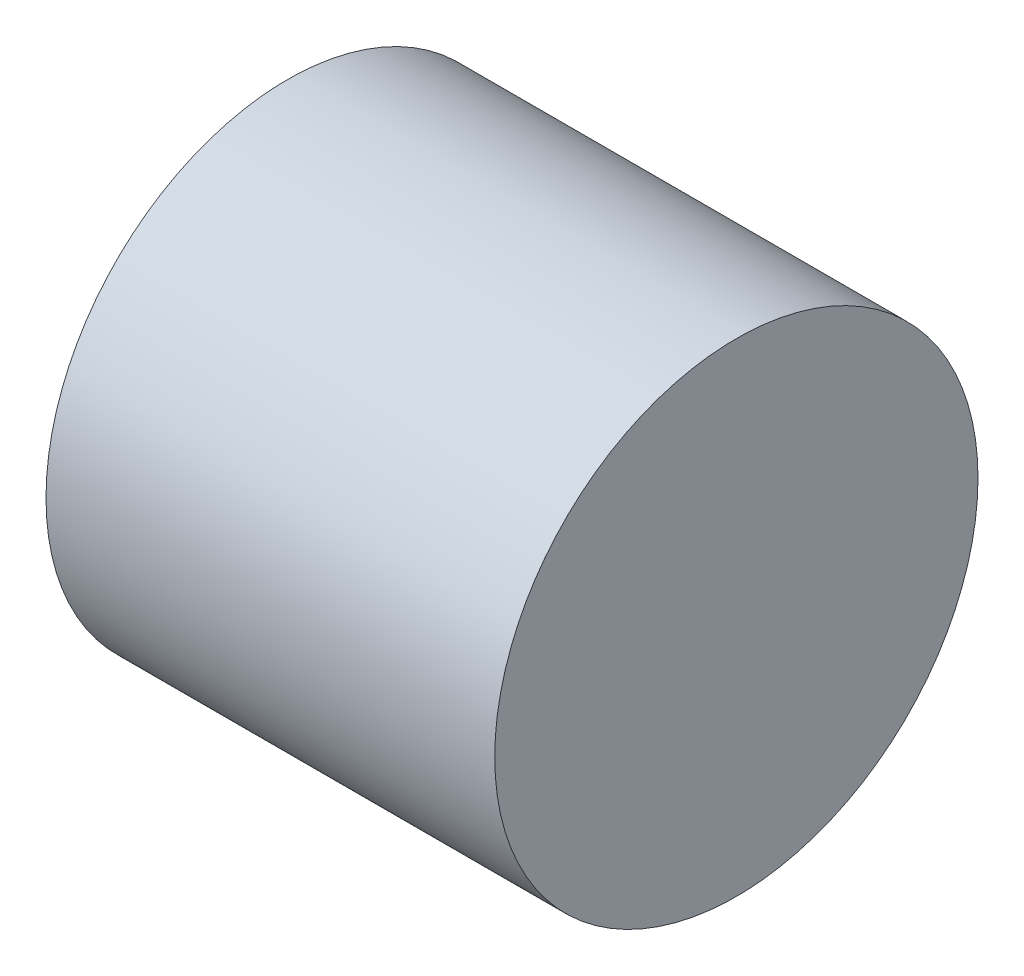
ISO-10303-21;
HEADER;
FILE_DESCRIPTION(('STEP AP214'),'2;1');
FILE_NAME('part.step','',(''),(''),'','','');
FILE_SCHEMA(('AUTOMOTIVE_DESIGN { 1 0 10303 214 1 1 1 1 }'));
ENDSEC;
DATA;
#1=APPLICATION_CONTEXT('core data for automotive mechanical design processes');
#2=APPLICATION_PROTOCOL_DEFINITION('international standard','automotive_design',2000,#1);
#3=PRODUCT_CONTEXT('',#1,'mechanical');
#4=PRODUCT('Part','Part','',(#3));
#5=PRODUCT_RELATED_PRODUCT_CATEGORY('part','',(#4));
#6=PRODUCT_DEFINITION_FORMATION('','',#4);
#7=PRODUCT_DEFINITION_CONTEXT('part definition',#1,'design');
#8=PRODUCT_DEFINITION('design','',#6,#7);
#9=PRODUCT_DEFINITION_SHAPE('','',#8);
#10=(LENGTH_UNIT() NAMED_UNIT(*) SI_UNIT(.MILLI.,.METRE.));
#11=(NAMED_UNIT(*) PLANE_ANGLE_UNIT() SI_UNIT($,.RADIAN.));
#12=(NAMED_UNIT(*) SI_UNIT($,.STERADIAN.) SOLID_ANGLE_UNIT());
#13=UNCERTAINTY_MEASURE_WITH_UNIT(LENGTH_MEASURE(1.E-05),#10,'distance_accuracy_value','');
#14=(GEOMETRIC_REPRESENTATION_CONTEXT(3) GLOBAL_UNCERTAINTY_ASSIGNED_CONTEXT((#13)) GLOBAL_UNIT_ASSIGNED_CONTEXT((#10,
#11,#12)) REPRESENTATION_CONTEXT('',''));
#15=CARTESIAN_POINT('',(0.,0.,0.));
#16=DIRECTION('',(0.,0.,1.));
#17=DIRECTION('',(1.,0.,0.));
#18=AXIS2_PLACEMENT_3D('',#15,#16,#17);
#19=CARTESIAN_POINT('',(13.,0.,0.));
#20=DIRECTION('',(-1.,0.,0.));
#21=DIRECTION('',(0.,0.,1.));
#22=AXIS2_PLACEMENT_3D('',#19,#20,#21);
#23=CYLINDRICAL_SURFACE('',#22,7.);
#24=CARTESIAN_POINT('',(13.,0.,0.));
#25=DIRECTION('',(1.,0.,0.));
#26=DIRECTION('',(0.,0.,-1.));
#27=AXIS2_PLACEMENT_3D('',#24,#25,#26);
#28=CIRCLE('',#27,7.);
#29=CARTESIAN_POINT('',(13.,0.,-7.));
#30=VERTEX_POINT('',#29);
#31=EDGE_CURVE('E10',#30,#30,#28,.T.);
#32=ORIENTED_EDGE('',*,*,#31,.F.);
#33=EDGE_LOOP('',(#32));
#34=FACE_BOUND('',#33,.T.);
#35=CARTESIAN_POINT('',(0.,0.,0.));
#36=DIRECTION('',(1.,0.,0.));
#37=DIRECTION('',(0.,0.,-1.));
#38=AXIS2_PLACEMENT_3D('',#35,#36,#37);
#39=CIRCLE('',#38,7.);
#40=CARTESIAN_POINT('',(0.,0.,-7.));
#41=VERTEX_POINT('',#40);
#42=EDGE_CURVE('E34',#41,#41,#39,.T.);
#43=ORIENTED_EDGE('',*,*,#42,.T.);
#44=EDGE_LOOP('',(#43));
#45=FACE_BOUND('',#44,.T.);
#46=ADVANCED_FACE('F31',(#34,#45),#23,.T.);
#47=CARTESIAN_POINT('',(13.,0.,0.));
#48=DIRECTION('',(1.,0.,0.));
#49=DIRECTION('',(0.,0.,-1.));
#50=AXIS2_PLACEMENT_3D('',#47,#48,#49);
#51=PLANE('',#50);
#52=ORIENTED_EDGE('',*,*,#31,.T.);
#53=EDGE_LOOP('',(#52));
#54=FACE_BOUND('',#53,.T.);
#55=ADVANCED_FACE('F46',(#54),#51,.T.);
#56=CARTESIAN_POINT('',(0.,0.,0.));
#57=DIRECTION('',(1.,0.,0.));
#58=DIRECTION('',(0.,0.,-1.));
#59=AXIS2_PLACEMENT_3D('',#56,#57,#58);
#60=PLANE('',#59);
#61=ORIENTED_EDGE('',*,*,#42,.F.);
#62=EDGE_LOOP('',(#61));
#63=FACE_BOUND('',#62,.T.);
#64=ADVANCED_FACE('F44',(#63),#60,.F.);
#65=CLOSED_SHELL('',(#46,#55,#64));
#66=MANIFOLD_SOLID_BREP('B2',#65);
#67=ADVANCED_BREP_SHAPE_REPRESENTATION('',(#18,#66),#14);
#68=SHAPE_DEFINITION_REPRESENTATION(#9,#67);
ENDSEC;
END-ISO-10303-21;
